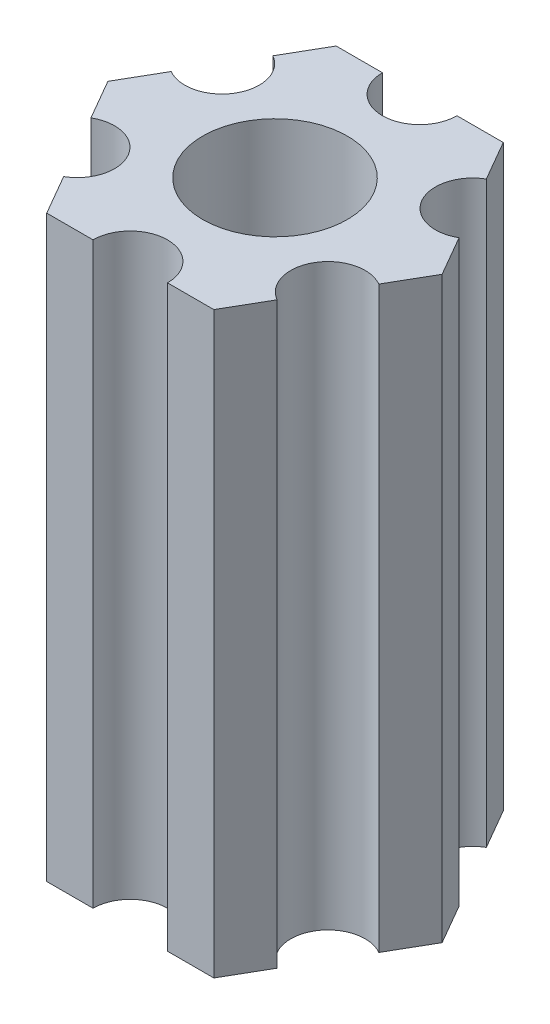
ISO-10303-21;
HEADER;
FILE_DESCRIPTION(('STEP AP214'),'2;1');
FILE_NAME('part.step','',(''),(''),'','','');
FILE_SCHEMA(('AUTOMOTIVE_DESIGN { 1 0 10303 214 1 1 1 1 }'));
ENDSEC;
DATA;
#1=APPLICATION_CONTEXT('core data for automotive mechanical design processes');
#2=APPLICATION_PROTOCOL_DEFINITION('international standard','automotive_design',2000,#1);
#3=PRODUCT_CONTEXT('',#1,'mechanical');
#4=PRODUCT('Part','Part','',(#3));
#5=PRODUCT_RELATED_PRODUCT_CATEGORY('part','',(#4));
#6=PRODUCT_DEFINITION_FORMATION('','',#4);
#7=PRODUCT_DEFINITION_CONTEXT('part definition',#1,'design');
#8=PRODUCT_DEFINITION('design','',#6,#7);
#9=PRODUCT_DEFINITION_SHAPE('','',#8);
#10=(LENGTH_UNIT() NAMED_UNIT(*) SI_UNIT(.MILLI.,.METRE.));
#11=(NAMED_UNIT(*) PLANE_ANGLE_UNIT() SI_UNIT($,.RADIAN.));
#12=(NAMED_UNIT(*) SI_UNIT($,.STERADIAN.) SOLID_ANGLE_UNIT());
#13=UNCERTAINTY_MEASURE_WITH_UNIT(LENGTH_MEASURE(1.E-05),#10,'distance_accuracy_value','');
#14=(GEOMETRIC_REPRESENTATION_CONTEXT(3) GLOBAL_UNCERTAINTY_ASSIGNED_CONTEXT((#13)) GLOBAL_UNIT_ASSIGNED_CONTEXT((#10,
#11,#12)) REPRESENTATION_CONTEXT('',''));
#15=CARTESIAN_POINT('',(0.,0.,0.));
#16=DIRECTION('',(0.,0.,1.));
#17=DIRECTION('',(1.,0.,0.));
#18=AXIS2_PLACEMENT_3D('',#15,#16,#17);
#19=CARTESIAN_POINT('',(-5.49926131403119,0.,-3.175));
#20=DIRECTION('',(0.,-1.,0.));
#21=DIRECTION('',(0.,0.,-1.));
#22=AXIS2_PLACEMENT_3D('',#19,#20,#21);
#23=CYLINDRICAL_SURFACE('',#22,1.63417420935412);
#24=CARTESIAN_POINT('',(-5.49926131403119,-25.4,-3.175));
#25=DIRECTION('',(0.,1.,0.));
#26=DIRECTION('',(0.,0.,1.));
#27=AXIS2_PLACEMENT_3D('',#24,#25,#26);
#28=CIRCLE('',#27,1.63417420935412);
#29=CARTESIAN_POINT('',(-6.31634841870825,-25.4,-1.75976362048998));
#30=VERTEX_POINT('',#29);
#31=CARTESIAN_POINT('',(-4.68217420935413,-25.4,-4.59023637951002));
#32=VERTEX_POINT('',#31);
#33=EDGE_CURVE('E206',#30,#32,#28,.T.);
#34=ORIENTED_EDGE('',*,*,#33,.F.);
#35=DIRECTION('',(0.,-1.,0.));
#36=VECTOR('',#35,1.);
#37=CARTESIAN_POINT('',(-6.31634841870825,0.,-1.75976362048998));
#38=LINE('',#37,#36);
#39=CARTESIAN_POINT('',(-6.31634841870825,0.,-1.75976362048998));
#40=VERTEX_POINT('',#39);
#41=EDGE_CURVE('E11',#40,#30,#38,.T.);
#42=ORIENTED_EDGE('',*,*,#41,.F.);
#43=CARTESIAN_POINT('',(-5.49926131403119,0.,-3.175));
#44=DIRECTION('',(0.,1.,0.));
#45=DIRECTION('',(0.,0.,1.));
#46=AXIS2_PLACEMENT_3D('',#43,#44,#45);
#47=CIRCLE('',#46,1.63417420935412);
#48=CARTESIAN_POINT('',(-4.68217420935413,0.,-4.59023637951002));
#49=VERTEX_POINT('',#48);
#50=EDGE_CURVE('E275',#40,#49,#47,.T.);
#51=ORIENTED_EDGE('',*,*,#50,.T.);
#52=DIRECTION('',(0.,-1.,0.));
#53=VECTOR('',#52,1.);
#54=CARTESIAN_POINT('',(-4.68217420935413,0.,-4.59023637951002));
#55=LINE('',#54,#53);
#56=EDGE_CURVE('E46',#49,#32,#55,.T.);
#57=ORIENTED_EDGE('',*,*,#56,.T.);
#58=EDGE_LOOP('',(#34,#42,#51,#57));
#59=FACE_BOUND('',#58,.T.);
#60=ADVANCED_FACE('F43',(#59),#23,.F.);
#61=CARTESIAN_POINT('',(-7.33234841870825,0.,0.));
#62=DIRECTION('',(-0.866025403784438,0.,-0.500000000000001));
#63=DIRECTION('',(-0.500000000000001,0.,0.866025403784438));
#64=AXIS2_PLACEMENT_3D('',#61,#62,#63);
#65=PLANE('',#64);
#66=DIRECTION('',(0.500000000000001,0.,-0.866025403784438));
#67=VECTOR('',#66,1.);
#68=CARTESIAN_POINT('',(-7.33234841870825,-25.4,0.));
#69=LINE('',#68,#67);
#70=CARTESIAN_POINT('',(-7.33234841870825,-25.4,0.));
#71=VERTEX_POINT('',#70);
#72=EDGE_CURVE('E272',#71,#30,#69,.T.);
#73=ORIENTED_EDGE('',*,*,#72,.F.);
#74=DIRECTION('',(0.,-1.,0.));
#75=VECTOR('',#74,1.);
#76=CARTESIAN_POINT('',(-7.33234841870825,0.,0.));
#77=LINE('',#76,#75);
#78=CARTESIAN_POINT('',(-7.33234841870825,0.,0.));
#79=VERTEX_POINT('',#78);
#80=EDGE_CURVE('E53',#79,#71,#77,.T.);
#81=ORIENTED_EDGE('',*,*,#80,.F.);
#82=DIRECTION('',(0.500000000000001,0.,-0.866025403784438));
#83=VECTOR('',#82,1.);
#84=CARTESIAN_POINT('',(-7.33234841870825,0.,0.));
#85=LINE('',#84,#83);
#86=EDGE_CURVE('E192',#79,#40,#85,.T.);
#87=ORIENTED_EDGE('',*,*,#86,.T.);
#88=ORIENTED_EDGE('',*,*,#41,.T.);
#89=EDGE_LOOP('',(#73,#81,#87,#88));
#90=FACE_BOUND('',#89,.T.);
#91=ADVANCED_FACE('F323',(#90),#65,.T.);
#92=CARTESIAN_POINT('',(-6.31634841870825,0.,1.75976362048999));
#93=DIRECTION('',(-0.86602540378444,0.,0.499999999999999));
#94=DIRECTION('',(0.499999999999999,0.,0.86602540378444));
#95=AXIS2_PLACEMENT_3D('',#92,#93,#94);
#96=PLANE('',#95);
#97=DIRECTION('',(-0.499999999999999,0.,-0.86602540378444));
#98=VECTOR('',#97,1.);
#99=CARTESIAN_POINT('',(-6.31634841870825,-25.4,1.75976362048999));
#100=LINE('',#99,#98);
#101=CARTESIAN_POINT('',(-6.31634841870825,-25.4,1.75976362048999));
#102=VERTEX_POINT('',#101);
#103=EDGE_CURVE('E178',#102,#71,#100,.T.);
#104=ORIENTED_EDGE('',*,*,#103,.F.);
#105=DIRECTION('',(0.,-1.,0.));
#106=VECTOR('',#105,1.);
#107=CARTESIAN_POINT('',(-6.31634841870825,0.,1.75976362048999));
#108=LINE('',#107,#106);
#109=CARTESIAN_POINT('',(-6.31634841870825,0.,1.75976362048999));
#110=VERTEX_POINT('',#109);
#111=EDGE_CURVE('E173',#110,#102,#108,.T.);
#112=ORIENTED_EDGE('',*,*,#111,.F.);
#113=DIRECTION('',(-0.499999999999999,0.,-0.86602540378444));
#114=VECTOR('',#113,1.);
#115=CARTESIAN_POINT('',(-6.31634841870825,0.,1.75976362048999));
#116=LINE('',#115,#114);
#117=EDGE_CURVE('E176',#110,#79,#116,.T.);
#118=ORIENTED_EDGE('',*,*,#117,.T.);
#119=ORIENTED_EDGE('',*,*,#80,.T.);
#120=EDGE_LOOP('',(#104,#112,#118,#119));
#121=FACE_BOUND('',#120,.T.);
#122=ADVANCED_FACE('F175',(#121),#96,.T.);
#123=CARTESIAN_POINT('',(-5.49926131403119,0.,3.175));
#124=DIRECTION('',(0.,-1.,0.));
#125=DIRECTION('',(0.,0.,-1.));
#126=AXIS2_PLACEMENT_3D('',#123,#124,#125);
#127=CYLINDRICAL_SURFACE('',#126,1.63417420935413);
#128=CARTESIAN_POINT('',(-5.49926131403119,-25.4,3.175));
#129=DIRECTION('',(0.,1.,0.));
#130=DIRECTION('',(0.,0.,1.));
#131=AXIS2_PLACEMENT_3D('',#128,#129,#130);
#132=CIRCLE('',#131,1.63417420935413);
#133=CARTESIAN_POINT('',(-4.68217420935412,-25.4,4.59023637951002));
#134=VERTEX_POINT('',#133);
#135=EDGE_CURVE('E267',#134,#102,#132,.T.);
#136=ORIENTED_EDGE('',*,*,#135,.F.);
#137=DIRECTION('',(0.,-1.,0.));
#138=VECTOR('',#137,1.);
#139=CARTESIAN_POINT('',(-4.68217420935412,0.,4.59023637951002));
#140=LINE('',#139,#138);
#141=CARTESIAN_POINT('',(-4.68217420935412,0.,4.59023637951002));
#142=VERTEX_POINT('',#141);
#143=EDGE_CURVE('E184',#142,#134,#140,.T.);
#144=ORIENTED_EDGE('',*,*,#143,.F.);
#145=CARTESIAN_POINT('',(-5.49926131403119,0.,3.175));
#146=DIRECTION('',(0.,1.,0.));
#147=DIRECTION('',(0.,0.,1.));
#148=AXIS2_PLACEMENT_3D('',#145,#146,#147);
#149=CIRCLE('',#148,1.63417420935413);
#150=EDGE_CURVE('E190',#142,#110,#149,.T.);
#151=ORIENTED_EDGE('',*,*,#150,.T.);
#152=ORIENTED_EDGE('',*,*,#111,.T.);
#153=EDGE_LOOP('',(#136,#144,#151,#152));
#154=FACE_BOUND('',#153,.T.);
#155=ADVANCED_FACE('F195',(#154),#127,.F.);
#156=CARTESIAN_POINT('',(-3.66617420935412,0.,6.35));
#157=DIRECTION('',(-0.866025403784439,0.,0.5));
#158=DIRECTION('',(0.5,0.,0.866025403784439));
#159=AXIS2_PLACEMENT_3D('',#156,#157,#158);
#160=PLANE('',#159);
#161=DIRECTION('',(-0.5,0.,-0.866025403784439));
#162=VECTOR('',#161,1.);
#163=CARTESIAN_POINT('',(-3.66617420935412,-25.4,6.35));
#164=LINE('',#163,#162);
#165=CARTESIAN_POINT('',(-3.66617420935412,-25.4,6.35));
#166=VERTEX_POINT('',#165);
#167=EDGE_CURVE('E263',#166,#134,#164,.T.);
#168=ORIENTED_EDGE('',*,*,#167,.F.);
#169=DIRECTION('',(0.,-1.,0.));
#170=VECTOR('',#169,1.);
#171=CARTESIAN_POINT('',(-3.66617420935412,0.,6.35));
#172=LINE('',#171,#170);
#173=CARTESIAN_POINT('',(-3.66617420935412,0.,6.35));
#174=VERTEX_POINT('',#173);
#175=EDGE_CURVE('E281',#174,#166,#172,.T.);
#176=ORIENTED_EDGE('',*,*,#175,.F.);
#177=DIRECTION('',(-0.5,0.,-0.866025403784439));
#178=VECTOR('',#177,1.);
#179=CARTESIAN_POINT('',(-3.66617420935412,0.,6.35));
#180=LINE('',#179,#178);
#181=EDGE_CURVE('E197',#174,#142,#180,.T.);
#182=ORIENTED_EDGE('',*,*,#181,.T.);
#183=ORIENTED_EDGE('',*,*,#143,.T.);
#184=EDGE_LOOP('',(#168,#176,#182,#183));
#185=FACE_BOUND('',#184,.T.);
#186=ADVANCED_FACE('F336',(#185),#160,.T.);
#187=CARTESIAN_POINT('',(-1.63417420935412,0.,6.35));
#188=DIRECTION('',(0.,0.,1.));
#189=DIRECTION('',(1.,0.,0.));
#190=AXIS2_PLACEMENT_3D('',#187,#188,#189);
#191=PLANE('',#190);
#192=DIRECTION('',(-1.,0.,0.));
#193=VECTOR('',#192,1.);
#194=CARTESIAN_POINT('',(-1.63417420935412,-25.4,6.35));
#195=LINE('',#194,#193);
#196=CARTESIAN_POINT('',(-1.63417420935412,-25.4,6.35));
#197=VERTEX_POINT('',#196);
#198=EDGE_CURVE('E259',#197,#166,#195,.T.);
#199=ORIENTED_EDGE('',*,*,#198,.F.);
#200=DIRECTION('',(0.,-1.,0.));
#201=VECTOR('',#200,1.);
#202=CARTESIAN_POINT('',(-1.63417420935412,0.,6.35));
#203=LINE('',#202,#201);
#204=CARTESIAN_POINT('',(-1.63417420935412,0.,6.35));
#205=VERTEX_POINT('',#204);
#206=EDGE_CURVE('E284',#205,#197,#203,.T.);
#207=ORIENTED_EDGE('',*,*,#206,.F.);
#208=DIRECTION('',(-1.,0.,0.));
#209=VECTOR('',#208,1.);
#210=CARTESIAN_POINT('',(-1.63417420935412,0.,6.35));
#211=LINE('',#210,#209);
#212=EDGE_CURVE('E200',#205,#174,#211,.T.);
#213=ORIENTED_EDGE('',*,*,#212,.T.);
#214=ORIENTED_EDGE('',*,*,#175,.T.);
#215=EDGE_LOOP('',(#199,#207,#213,#214));
#216=FACE_BOUND('',#215,.T.);
#217=ADVANCED_FACE('F339',(#216),#191,.T.);
#218=CARTESIAN_POINT('',(0.,0.,6.35));
#219=DIRECTION('',(0.,-1.,0.));
#220=DIRECTION('',(0.,0.,-1.));
#221=AXIS2_PLACEMENT_3D('',#218,#219,#220);
#222=CYLINDRICAL_SURFACE('',#221,1.63417420935412);
#223=CARTESIAN_POINT('',(0.,-25.4,6.35));
#224=DIRECTION('',(0.,1.,0.));
#225=DIRECTION('',(0.,0.,1.));
#226=AXIS2_PLACEMENT_3D('',#223,#224,#225);
#227=CIRCLE('',#226,1.63417420935412);
#228=CARTESIAN_POINT('',(1.63417420935413,-25.4,6.35));
#229=VERTEX_POINT('',#228);
#230=EDGE_CURVE('E255',#229,#197,#227,.T.);
#231=ORIENTED_EDGE('',*,*,#230,.F.);
#232=DIRECTION('',(0.,-1.,0.));
#233=VECTOR('',#232,1.);
#234=CARTESIAN_POINT('',(1.63417420935413,0.,6.35));
#235=LINE('',#234,#233);
#236=CARTESIAN_POINT('',(1.63417420935413,0.,6.35));
#237=VERTEX_POINT('',#236);
#238=EDGE_CURVE('E287',#237,#229,#235,.T.);
#239=ORIENTED_EDGE('',*,*,#238,.F.);
#240=CARTESIAN_POINT('',(0.,0.,6.35));
#241=DIRECTION('',(0.,1.,0.));
#242=DIRECTION('',(0.,0.,1.));
#243=AXIS2_PLACEMENT_3D('',#240,#241,#242);
#244=CIRCLE('',#243,1.63417420935412);
#245=EDGE_CURVE('E458',#237,#205,#244,.T.);
#246=ORIENTED_EDGE('',*,*,#245,.T.);
#247=ORIENTED_EDGE('',*,*,#206,.T.);
#248=EDGE_LOOP('',(#231,#239,#246,#247));
#249=FACE_BOUND('',#248,.T.);
#250=ADVANCED_FACE('F343',(#249),#222,.F.);
#251=CARTESIAN_POINT('',(3.66617420935412,0.,6.35));
#252=DIRECTION('',(0.,0.,1.));
#253=DIRECTION('',(1.,0.,0.));
#254=AXIS2_PLACEMENT_3D('',#251,#252,#253);
#255=PLANE('',#254);
#256=DIRECTION('',(-1.,0.,0.));
#257=VECTOR('',#256,1.);
#258=CARTESIAN_POINT('',(3.66617420935412,-25.4,6.35));
#259=LINE('',#258,#257);
#260=CARTESIAN_POINT('',(3.66617420935412,-25.4,6.35));
#261=VERTEX_POINT('',#260);
#262=EDGE_CURVE('E251',#261,#229,#259,.T.);
#263=ORIENTED_EDGE('',*,*,#262,.F.);
#264=DIRECTION('',(0.,-1.,0.));
#265=VECTOR('',#264,1.);
#266=CARTESIAN_POINT('',(3.66617420935412,0.,6.35));
#267=LINE('',#266,#265);
#268=CARTESIAN_POINT('',(3.66617420935412,0.,6.35));
#269=VERTEX_POINT('',#268);
#270=EDGE_CURVE('E290',#269,#261,#267,.T.);
#271=ORIENTED_EDGE('',*,*,#270,.F.);
#272=DIRECTION('',(-1.,0.,0.));
#273=VECTOR('',#272,1.);
#274=CARTESIAN_POINT('',(3.66617420935412,0.,6.35));
#275=LINE('',#274,#273);
#276=EDGE_CURVE('E454',#269,#237,#275,.T.);
#277=ORIENTED_EDGE('',*,*,#276,.T.);
#278=ORIENTED_EDGE('',*,*,#238,.T.);
#279=EDGE_LOOP('',(#263,#271,#277,#278));
#280=FACE_BOUND('',#279,.T.);
#281=ADVANCED_FACE('F347',(#280),#255,.T.);
#282=CARTESIAN_POINT('',(4.68217420935413,0.,4.59023637951002));
#283=DIRECTION('',(0.866025403784436,0.,0.500000000000004));
#284=DIRECTION('',(0.500000000000004,0.,-0.866025403784436));
#285=AXIS2_PLACEMENT_3D('',#282,#283,#284);
#286=PLANE('',#285);
#287=DIRECTION('',(-0.500000000000004,0.,0.866025403784436));
#288=VECTOR('',#287,1.);
#289=CARTESIAN_POINT('',(4.68217420935413,-25.4,4.59023637951002));
#290=LINE('',#289,#288);
#291=CARTESIAN_POINT('',(4.68217420935413,-25.4,4.59023637951002));
#292=VERTEX_POINT('',#291);
#293=EDGE_CURVE('E247',#292,#261,#290,.T.);
#294=ORIENTED_EDGE('',*,*,#293,.F.);
#295=DIRECTION('',(0.,-1.,0.));
#296=VECTOR('',#295,1.);
#297=CARTESIAN_POINT('',(4.68217420935413,0.,4.59023637951002));
#298=LINE('',#297,#296);
#299=CARTESIAN_POINT('',(4.68217420935413,0.,4.59023637951002));
#300=VERTEX_POINT('',#299);
#301=EDGE_CURVE('E293',#300,#292,#298,.T.);
#302=ORIENTED_EDGE('',*,*,#301,.F.);
#303=DIRECTION('',(-0.500000000000004,0.,0.866025403784436));
#304=VECTOR('',#303,1.);
#305=CARTESIAN_POINT('',(4.68217420935413,0.,4.59023637951002));
#306=LINE('',#305,#304);
#307=EDGE_CURVE('E450',#300,#269,#306,.T.);
#308=ORIENTED_EDGE('',*,*,#307,.T.);
#309=ORIENTED_EDGE('',*,*,#270,.T.);
#310=EDGE_LOOP('',(#294,#302,#308,#309));
#311=FACE_BOUND('',#310,.T.);
#312=ADVANCED_FACE('F351',(#311),#286,.T.);
#313=CARTESIAN_POINT('',(5.49926131403119,0.,3.175));
#314=DIRECTION('',(0.,-1.,0.));
#315=DIRECTION('',(0.,0.,-1.));
#316=AXIS2_PLACEMENT_3D('',#313,#314,#315);
#317=CYLINDRICAL_SURFACE('',#316,1.63417420935412);
#318=CARTESIAN_POINT('',(5.49926131403119,-25.4,3.175));
#319=DIRECTION('',(0.,1.,0.));
#320=DIRECTION('',(0.,0.,1.));
#321=AXIS2_PLACEMENT_3D('',#318,#319,#320);
#322=CIRCLE('',#321,1.63417420935412);
#323=CARTESIAN_POINT('',(6.31634841870825,-25.4,1.75976362048998));
#324=VERTEX_POINT('',#323);
#325=EDGE_CURVE('E243',#324,#292,#322,.T.);
#326=ORIENTED_EDGE('',*,*,#325,.F.);
#327=DIRECTION('',(0.,-1.,0.));
#328=VECTOR('',#327,1.);
#329=CARTESIAN_POINT('',(6.31634841870825,0.,1.75976362048998));
#330=LINE('',#329,#328);
#331=CARTESIAN_POINT('',(6.31634841870825,0.,1.75976362048998));
#332=VERTEX_POINT('',#331);
#333=EDGE_CURVE('E296',#332,#324,#330,.T.);
#334=ORIENTED_EDGE('',*,*,#333,.F.);
#335=CARTESIAN_POINT('',(5.49926131403119,0.,3.175));
#336=DIRECTION('',(0.,1.,0.));
#337=DIRECTION('',(0.,0.,1.));
#338=AXIS2_PLACEMENT_3D('',#335,#336,#337);
#339=CIRCLE('',#338,1.63417420935412);
#340=EDGE_CURVE('E446',#332,#300,#339,.T.);
#341=ORIENTED_EDGE('',*,*,#340,.T.);
#342=ORIENTED_EDGE('',*,*,#301,.T.);
#343=EDGE_LOOP('',(#326,#334,#341,#342));
#344=FACE_BOUND('',#343,.T.);
#345=ADVANCED_FACE('F355',(#344),#317,.F.);
#346=CARTESIAN_POINT('',(7.33234841870825,0.,0.));
#347=DIRECTION('',(0.866025403784439,0.,0.499999999999999));
#348=DIRECTION('',(0.499999999999999,0.,-0.866025403784439));
#349=AXIS2_PLACEMENT_3D('',#346,#347,#348);
#350=PLANE('',#349);
#351=DIRECTION('',(-0.499999999999999,0.,0.866025403784439));
#352=VECTOR('',#351,1.);
#353=CARTESIAN_POINT('',(7.33234841870825,-25.4,0.));
#354=LINE('',#353,#352);
#355=CARTESIAN_POINT('',(7.33234841870825,-25.4,0.));
#356=VERTEX_POINT('',#355);
#357=EDGE_CURVE('E239',#356,#324,#354,.T.);
#358=ORIENTED_EDGE('',*,*,#357,.F.);
#359=DIRECTION('',(0.,-1.,0.));
#360=VECTOR('',#359,1.);
#361=CARTESIAN_POINT('',(7.33234841870825,0.,0.));
#362=LINE('',#361,#360);
#363=CARTESIAN_POINT('',(7.33234841870825,0.,0.));
#364=VERTEX_POINT('',#363);
#365=EDGE_CURVE('E299',#364,#356,#362,.T.);
#366=ORIENTED_EDGE('',*,*,#365,.F.);
#367=DIRECTION('',(-0.499999999999999,0.,0.866025403784439));
#368=VECTOR('',#367,1.);
#369=CARTESIAN_POINT('',(7.33234841870825,0.,0.));
#370=LINE('',#369,#368);
#371=EDGE_CURVE('E442',#364,#332,#370,.T.);
#372=ORIENTED_EDGE('',*,*,#371,.T.);
#373=ORIENTED_EDGE('',*,*,#333,.T.);
#374=EDGE_LOOP('',(#358,#366,#372,#373));
#375=FACE_BOUND('',#374,.T.);
#376=ADVANCED_FACE('F359',(#375),#350,.T.);
#377=CARTESIAN_POINT('',(6.31634841870825,0.,-1.75976362048998));
#378=DIRECTION('',(0.866025403784439,0.,-0.5));
#379=DIRECTION('',(-0.5,0.,-0.866025403784439));
#380=AXIS2_PLACEMENT_3D('',#377,#378,#379);
#381=PLANE('',#380);
#382=DIRECTION('',(0.5,0.,0.866025403784438));
#383=VECTOR('',#382,1.);
#384=CARTESIAN_POINT('',(6.31634841870825,-25.4,-1.75976362048998));
#385=LINE('',#384,#383);
#386=CARTESIAN_POINT('',(6.31634841870825,-25.4,-1.75976362048998));
#387=VERTEX_POINT('',#386);
#388=EDGE_CURVE('E235',#387,#356,#385,.T.);
#389=ORIENTED_EDGE('',*,*,#388,.F.);
#390=DIRECTION('',(0.,-1.,0.));
#391=VECTOR('',#390,1.);
#392=CARTESIAN_POINT('',(6.31634841870825,0.,-1.75976362048998));
#393=LINE('',#392,#391);
#394=CARTESIAN_POINT('',(6.31634841870825,0.,-1.75976362048998));
#395=VERTEX_POINT('',#394);
#396=EDGE_CURVE('E302',#395,#387,#393,.T.);
#397=ORIENTED_EDGE('',*,*,#396,.F.);
#398=DIRECTION('',(0.5,0.,0.866025403784438));
#399=VECTOR('',#398,1.);
#400=CARTESIAN_POINT('',(6.31634841870825,0.,-1.75976362048998));
#401=LINE('',#400,#399);
#402=EDGE_CURVE('E438',#395,#364,#401,.T.);
#403=ORIENTED_EDGE('',*,*,#402,.T.);
#404=ORIENTED_EDGE('',*,*,#365,.T.);
#405=EDGE_LOOP('',(#389,#397,#403,#404));
#406=FACE_BOUND('',#405,.T.);
#407=ADVANCED_FACE('F363',(#406),#381,.T.);
#408=CARTESIAN_POINT('',(5.49926131403119,0.,-3.175));
#409=DIRECTION('',(0.,-1.,0.));
#410=DIRECTION('',(0.,0.,-1.));
#411=AXIS2_PLACEMENT_3D('',#408,#409,#410);
#412=CYLINDRICAL_SURFACE('',#411,1.63417420935413);
#413=CARTESIAN_POINT('',(5.49926131403119,-25.4,-3.175));
#414=DIRECTION('',(0.,1.,0.));
#415=DIRECTION('',(0.,0.,1.));
#416=AXIS2_PLACEMENT_3D('',#413,#414,#415);
#417=CIRCLE('',#416,1.63417420935413);
#418=CARTESIAN_POINT('',(4.68217420935412,-25.4,-4.59023637951002));
#419=VERTEX_POINT('',#418);
#420=EDGE_CURVE('E231',#419,#387,#417,.T.);
#421=ORIENTED_EDGE('',*,*,#420,.F.);
#422=DIRECTION('',(0.,-1.,0.));
#423=VECTOR('',#422,1.);
#424=CARTESIAN_POINT('',(4.68217420935412,0.,-4.59023637951002));
#425=LINE('',#424,#423);
#426=CARTESIAN_POINT('',(4.68217420935412,0.,-4.59023637951002));
#427=VERTEX_POINT('',#426);
#428=EDGE_CURVE('E305',#427,#419,#425,.T.);
#429=ORIENTED_EDGE('',*,*,#428,.F.);
#430=CARTESIAN_POINT('',(5.49926131403119,0.,-3.175));
#431=DIRECTION('',(0.,1.,0.));
#432=DIRECTION('',(0.,0.,1.));
#433=AXIS2_PLACEMENT_3D('',#430,#431,#432);
#434=CIRCLE('',#433,1.63417420935413);
#435=EDGE_CURVE('E434',#427,#395,#434,.T.);
#436=ORIENTED_EDGE('',*,*,#435,.T.);
#437=ORIENTED_EDGE('',*,*,#396,.T.);
#438=EDGE_LOOP('',(#421,#429,#436,#437));
#439=FACE_BOUND('',#438,.T.);
#440=ADVANCED_FACE('F367',(#439),#412,.F.);
#441=CARTESIAN_POINT('',(3.66617420935412,0.,-6.35));
#442=DIRECTION('',(0.86602540378444,0.,-0.499999999999998));
#443=DIRECTION('',(-0.499999999999998,0.,-0.86602540378444));
#444=AXIS2_PLACEMENT_3D('',#441,#442,#443);
#445=PLANE('',#444);
#446=DIRECTION('',(0.499999999999998,0.,0.86602540378444));
#447=VECTOR('',#446,1.);
#448=CARTESIAN_POINT('',(3.66617420935412,-25.4,-6.35));
#449=LINE('',#448,#447);
#450=CARTESIAN_POINT('',(3.66617420935412,-25.4,-6.35));
#451=VERTEX_POINT('',#450);
#452=EDGE_CURVE('E227',#451,#419,#449,.T.);
#453=ORIENTED_EDGE('',*,*,#452,.F.);
#454=DIRECTION('',(0.,-1.,0.));
#455=VECTOR('',#454,1.);
#456=CARTESIAN_POINT('',(3.66617420935412,0.,-6.35));
#457=LINE('',#456,#455);
#458=CARTESIAN_POINT('',(3.66617420935412,0.,-6.35));
#459=VERTEX_POINT('',#458);
#460=EDGE_CURVE('E308',#459,#451,#457,.T.);
#461=ORIENTED_EDGE('',*,*,#460,.F.);
#462=DIRECTION('',(0.499999999999998,0.,0.86602540378444));
#463=VECTOR('',#462,1.);
#464=CARTESIAN_POINT('',(3.66617420935412,0.,-6.35));
#465=LINE('',#464,#463);
#466=EDGE_CURVE('E430',#459,#427,#465,.T.);
#467=ORIENTED_EDGE('',*,*,#466,.T.);
#468=ORIENTED_EDGE('',*,*,#428,.T.);
#469=EDGE_LOOP('',(#453,#461,#467,#468));
#470=FACE_BOUND('',#469,.T.);
#471=ADVANCED_FACE('F371',(#470),#445,.T.);
#472=CARTESIAN_POINT('',(1.63417420935412,0.,-6.35));
#473=DIRECTION('',(0.,0.,-1.));
#474=DIRECTION('',(-1.,0.,0.));
#475=AXIS2_PLACEMENT_3D('',#472,#473,#474);
#476=PLANE('',#475);
#477=DIRECTION('',(1.,0.,0.));
#478=VECTOR('',#477,1.);
#479=CARTESIAN_POINT('',(1.63417420935412,-25.4,-6.35));
#480=LINE('',#479,#478);
#481=CARTESIAN_POINT('',(1.63417420935412,-25.4,-6.35));
#482=VERTEX_POINT('',#481);
#483=EDGE_CURVE('E223',#482,#451,#480,.T.);
#484=ORIENTED_EDGE('',*,*,#483,.F.);
#485=DIRECTION('',(0.,-1.,0.));
#486=VECTOR('',#485,1.);
#487=CARTESIAN_POINT('',(1.63417420935412,0.,-6.35));
#488=LINE('',#487,#486);
#489=CARTESIAN_POINT('',(1.63417420935412,0.,-6.35));
#490=VERTEX_POINT('',#489);
#491=EDGE_CURVE('E311',#490,#482,#488,.T.);
#492=ORIENTED_EDGE('',*,*,#491,.F.);
#493=DIRECTION('',(1.,0.,0.));
#494=VECTOR('',#493,1.);
#495=CARTESIAN_POINT('',(1.63417420935412,0.,-6.35));
#496=LINE('',#495,#494);
#497=EDGE_CURVE('E426',#490,#459,#496,.T.);
#498=ORIENTED_EDGE('',*,*,#497,.T.);
#499=ORIENTED_EDGE('',*,*,#460,.T.);
#500=EDGE_LOOP('',(#484,#492,#498,#499));
#501=FACE_BOUND('',#500,.T.);
#502=ADVANCED_FACE('F375',(#501),#476,.T.);
#503=CARTESIAN_POINT('',(0.,0.,-6.35));
#504=DIRECTION('',(0.,-1.,0.));
#505=DIRECTION('',(0.,0.,-1.));
#506=AXIS2_PLACEMENT_3D('',#503,#504,#505);
#507=CYLINDRICAL_SURFACE('',#506,1.63417420935412);
#508=CARTESIAN_POINT('',(0.,-25.4,-6.35));
#509=DIRECTION('',(0.,1.,0.));
#510=DIRECTION('',(0.,0.,1.));
#511=AXIS2_PLACEMENT_3D('',#508,#509,#510);
#512=CIRCLE('',#511,1.63417420935412);
#513=CARTESIAN_POINT('',(-1.63417420935413,-25.4,-6.35));
#514=VERTEX_POINT('',#513);
#515=EDGE_CURVE('E219',#514,#482,#512,.T.);
#516=ORIENTED_EDGE('',*,*,#515,.F.);
#517=DIRECTION('',(0.,-1.,0.));
#518=VECTOR('',#517,1.);
#519=CARTESIAN_POINT('',(-1.63417420935413,0.,-6.35));
#520=LINE('',#519,#518);
#521=CARTESIAN_POINT('',(-1.63417420935413,0.,-6.35));
#522=VERTEX_POINT('',#521);
#523=EDGE_CURVE('E314',#522,#514,#520,.T.);
#524=ORIENTED_EDGE('',*,*,#523,.F.);
#525=CARTESIAN_POINT('',(0.,0.,-6.35));
#526=DIRECTION('',(0.,1.,0.));
#527=DIRECTION('',(0.,0.,1.));
#528=AXIS2_PLACEMENT_3D('',#525,#526,#527);
#529=CIRCLE('',#528,1.63417420935412);
#530=EDGE_CURVE('E422',#522,#490,#529,.T.);
#531=ORIENTED_EDGE('',*,*,#530,.T.);
#532=ORIENTED_EDGE('',*,*,#491,.T.);
#533=EDGE_LOOP('',(#516,#524,#531,#532));
#534=FACE_BOUND('',#533,.T.);
#535=ADVANCED_FACE('F379',(#534),#507,.F.);
#536=CARTESIAN_POINT('',(-3.66617420935412,0.,-6.35));
#537=DIRECTION('',(0.,0.,-1.));
#538=DIRECTION('',(-1.,0.,0.));
#539=AXIS2_PLACEMENT_3D('',#536,#537,#538);
#540=PLANE('',#539);
#541=DIRECTION('',(1.,0.,0.));
#542=VECTOR('',#541,1.);
#543=CARTESIAN_POINT('',(-3.66617420935412,-25.4,-6.35));
#544=LINE('',#543,#542);
#545=CARTESIAN_POINT('',(-3.66617420935412,-25.4,-6.35));
#546=VERTEX_POINT('',#545);
#547=EDGE_CURVE('E215',#546,#514,#544,.T.);
#548=ORIENTED_EDGE('',*,*,#547,.F.);
#549=DIRECTION('',(0.,-1.,0.));
#550=VECTOR('',#549,1.);
#551=CARTESIAN_POINT('',(-3.66617420935412,0.,-6.35));
#552=LINE('',#551,#550);
#553=CARTESIAN_POINT('',(-3.66617420935412,0.,-6.35));
#554=VERTEX_POINT('',#553);
#555=EDGE_CURVE('E316',#554,#546,#552,.T.);
#556=ORIENTED_EDGE('',*,*,#555,.F.);
#557=DIRECTION('',(1.,0.,0.));
#558=VECTOR('',#557,1.);
#559=CARTESIAN_POINT('',(-3.66617420935412,0.,-6.35));
#560=LINE('',#559,#558);
#561=EDGE_CURVE('E418',#554,#522,#560,.T.);
#562=ORIENTED_EDGE('',*,*,#561,.T.);
#563=ORIENTED_EDGE('',*,*,#523,.T.);
#564=EDGE_LOOP('',(#548,#556,#562,#563));
#565=FACE_BOUND('',#564,.T.);
#566=ADVANCED_FACE('F383',(#565),#540,.T.);
#567=CARTESIAN_POINT('',(-4.68217420935413,0.,-4.59023637951002));
#568=DIRECTION('',(-0.866025403784437,0.,-0.500000000000002));
#569=DIRECTION('',(-0.500000000000002,0.,0.866025403784438));
#570=AXIS2_PLACEMENT_3D('',#567,#568,#569);
#571=PLANE('',#570);
#572=DIRECTION('',(0.500000000000002,0.,-0.866025403784437));
#573=VECTOR('',#572,1.);
#574=CARTESIAN_POINT('',(-4.68217420935413,-25.4,-4.59023637951002));
#575=LINE('',#574,#573);
#576=EDGE_CURVE('E210',#32,#546,#575,.T.);
#577=ORIENTED_EDGE('',*,*,#576,.F.);
#578=ORIENTED_EDGE('',*,*,#56,.F.);
#579=DIRECTION('',(0.500000000000002,0.,-0.866025403784437));
#580=VECTOR('',#579,1.);
#581=CARTESIAN_POINT('',(-4.68217420935413,0.,-4.59023637951002));
#582=LINE('',#581,#580);
#583=EDGE_CURVE('E415',#49,#554,#582,.T.);
#584=ORIENTED_EDGE('',*,*,#583,.T.);
#585=ORIENTED_EDGE('',*,*,#555,.T.);
#586=EDGE_LOOP('',(#577,#578,#584,#585));
#587=FACE_BOUND('',#586,.T.);
#588=ADVANCED_FACE('F320',(#587),#571,.T.);
#589=CARTESIAN_POINT('',(-5.49926131403119,0.,-3.175));
#590=DIRECTION('',(0.,1.,0.));
#591=DIRECTION('',(0.,0.,1.));
#592=AXIS2_PLACEMENT_3D('',#589,#590,#591);
#593=PLANE('',#592);
#594=CARTESIAN_POINT('',(0.,0.,0.));
#595=DIRECTION('',(0.,-1.,0.));
#596=DIRECTION('',(0.,0.,1.));
#597=AXIS2_PLACEMENT_3D('',#594,#595,#596);
#598=CIRCLE('',#597,3.175);
#599=CARTESIAN_POINT('',(0.,0.,3.175));
#600=VERTEX_POINT('',#599);
#601=EDGE_CURVE('E211',#600,#600,#598,.T.);
#602=ORIENTED_EDGE('',*,*,#601,.T.);
#603=EDGE_LOOP('',(#602));
#604=FACE_BOUND('',#603,.T.);
#605=ORIENTED_EDGE('',*,*,#50,.F.);
#606=ORIENTED_EDGE('',*,*,#86,.F.);
#607=ORIENTED_EDGE('',*,*,#117,.F.);
#608=ORIENTED_EDGE('',*,*,#150,.F.);
#609=ORIENTED_EDGE('',*,*,#181,.F.);
#610=ORIENTED_EDGE('',*,*,#212,.F.);
#611=ORIENTED_EDGE('',*,*,#245,.F.);
#612=ORIENTED_EDGE('',*,*,#276,.F.);
#613=ORIENTED_EDGE('',*,*,#307,.F.);
#614=ORIENTED_EDGE('',*,*,#340,.F.);
#615=ORIENTED_EDGE('',*,*,#371,.F.);
#616=ORIENTED_EDGE('',*,*,#402,.F.);
#617=ORIENTED_EDGE('',*,*,#435,.F.);
#618=ORIENTED_EDGE('',*,*,#466,.F.);
#619=ORIENTED_EDGE('',*,*,#497,.F.);
#620=ORIENTED_EDGE('',*,*,#530,.F.);
#621=ORIENTED_EDGE('',*,*,#561,.F.);
#622=ORIENTED_EDGE('',*,*,#583,.F.);
#623=EDGE_LOOP('',(#605,#606,#607,#608,#609,#610,#611,#612,#613,#614,#615,#616,#617,#618,#619,
#620,#621,#622));
#624=FACE_BOUND('',#623,.T.);
#625=ADVANCED_FACE('F188',(#604,#624),#593,.T.);
#626=CARTESIAN_POINT('',(-5.49926131403119,-25.4,-3.175));
#627=DIRECTION('',(0.,1.,0.));
#628=DIRECTION('',(0.,0.,1.));
#629=AXIS2_PLACEMENT_3D('',#626,#627,#628);
#630=PLANE('',#629);
#631=CARTESIAN_POINT('',(0.,-25.4,0.));
#632=DIRECTION('',(0.,-1.,0.));
#633=DIRECTION('',(0.,0.,1.));
#634=AXIS2_PLACEMENT_3D('',#631,#632,#633);
#635=CIRCLE('',#634,3.175);
#636=CARTESIAN_POINT('',(0.,-25.4,3.175));
#637=VERTEX_POINT('',#636);
#638=EDGE_CURVE('E407',#637,#637,#635,.T.);
#639=ORIENTED_EDGE('',*,*,#638,.F.);
#640=EDGE_LOOP('',(#639));
#641=FACE_BOUND('',#640,.T.);
#642=ORIENTED_EDGE('',*,*,#33,.T.);
#643=ORIENTED_EDGE('',*,*,#576,.T.);
#644=ORIENTED_EDGE('',*,*,#547,.T.);
#645=ORIENTED_EDGE('',*,*,#515,.T.);
#646=ORIENTED_EDGE('',*,*,#483,.T.);
#647=ORIENTED_EDGE('',*,*,#452,.T.);
#648=ORIENTED_EDGE('',*,*,#420,.T.);
#649=ORIENTED_EDGE('',*,*,#388,.T.);
#650=ORIENTED_EDGE('',*,*,#357,.T.);
#651=ORIENTED_EDGE('',*,*,#325,.T.);
#652=ORIENTED_EDGE('',*,*,#293,.T.);
#653=ORIENTED_EDGE('',*,*,#262,.T.);
#654=ORIENTED_EDGE('',*,*,#230,.T.);
#655=ORIENTED_EDGE('',*,*,#198,.T.);
#656=ORIENTED_EDGE('',*,*,#167,.T.);
#657=ORIENTED_EDGE('',*,*,#135,.T.);
#658=ORIENTED_EDGE('',*,*,#103,.T.);
#659=ORIENTED_EDGE('',*,*,#72,.T.);
#660=EDGE_LOOP('',(#642,#643,#644,#645,#646,#647,#648,#649,#650,#651,#652,#653,#654,#655,#656,
#657,#658,#659));
#661=FACE_BOUND('',#660,.T.);
#662=ADVANCED_FACE('F322',(#641,#661),#630,.F.);
#663=CARTESIAN_POINT('',(0.,0.,0.));
#664=DIRECTION('',(0.,-1.,0.));
#665=DIRECTION('',(0.,0.,-1.));
#666=AXIS2_PLACEMENT_3D('',#663,#664,#665);
#667=CYLINDRICAL_SURFACE('',#666,3.175);
#668=ORIENTED_EDGE('',*,*,#601,.F.);
#669=EDGE_LOOP('',(#668));
#670=FACE_BOUND('',#669,.T.);
#671=ORIENTED_EDGE('',*,*,#638,.T.);
#672=EDGE_LOOP('',(#671));
#673=FACE_BOUND('',#672,.T.);
#674=ADVANCED_FACE('F395',(#670,#673),#667,.F.);
#675=CLOSED_SHELL('',(#60,#91,#122,#155,#186,#217,#250,#281,#312,#345,#376,#407,#440,#471,#502,
#535,#566,#588,#625,#662,#674));
#676=MANIFOLD_SOLID_BREP('B2',#675);
#677=ADVANCED_BREP_SHAPE_REPRESENTATION('',(#18,#676),#14);
#678=SHAPE_DEFINITION_REPRESENTATION(#9,#677);
ENDSEC;
END-ISO-10303-21;
